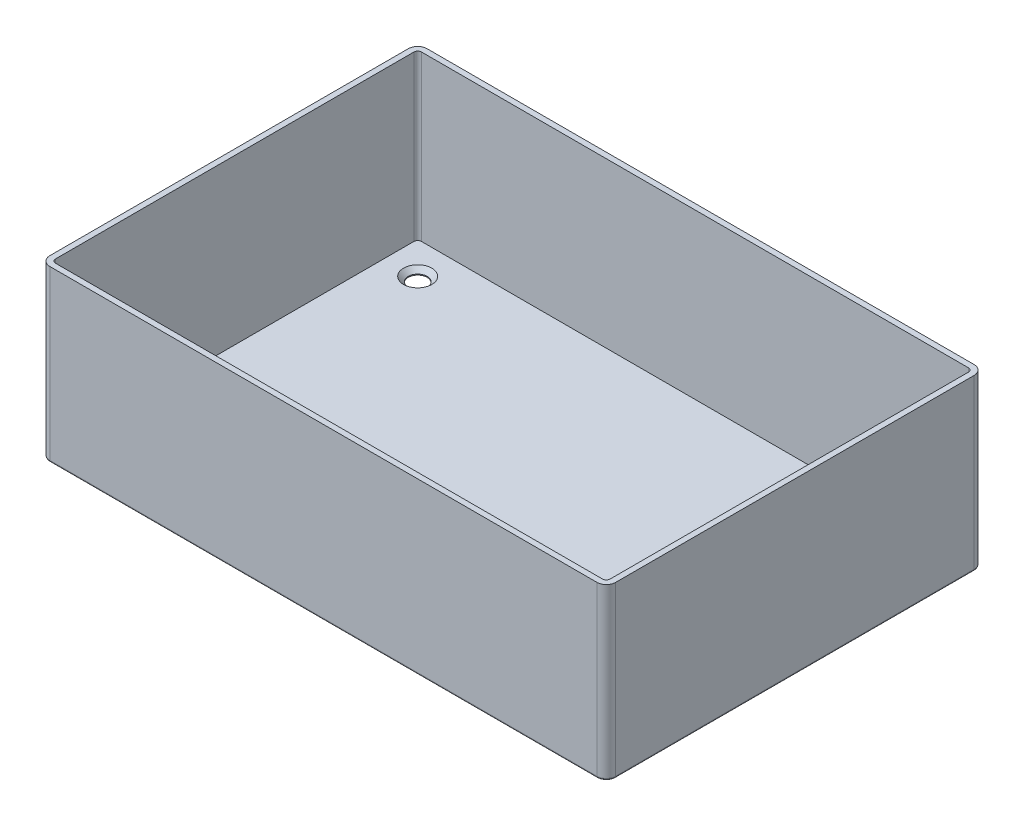
ISO-10303-21;
HEADER;
FILE_DESCRIPTION(('STEP AP214'),'2;1');
FILE_NAME('part.step','',(''),(''),'','','');
FILE_SCHEMA(('AUTOMOTIVE_DESIGN { 1 0 10303 214 1 1 1 1 }'));
ENDSEC;
DATA;
#1=APPLICATION_CONTEXT('core data for automotive mechanical design processes');
#2=APPLICATION_PROTOCOL_DEFINITION('international standard','automotive_design',2000,#1);
#3=PRODUCT_CONTEXT('',#1,'mechanical');
#4=PRODUCT('Part','Part','',(#3));
#5=PRODUCT_RELATED_PRODUCT_CATEGORY('part','',(#4));
#6=PRODUCT_DEFINITION_FORMATION('','',#4);
#7=PRODUCT_DEFINITION_CONTEXT('part definition',#1,'design');
#8=PRODUCT_DEFINITION('design','',#6,#7);
#9=PRODUCT_DEFINITION_SHAPE('','',#8);
#10=(LENGTH_UNIT() NAMED_UNIT(*) SI_UNIT(.MILLI.,.METRE.));
#11=(NAMED_UNIT(*) PLANE_ANGLE_UNIT() SI_UNIT($,.RADIAN.));
#12=(NAMED_UNIT(*) SI_UNIT($,.STERADIAN.) SOLID_ANGLE_UNIT());
#13=UNCERTAINTY_MEASURE_WITH_UNIT(LENGTH_MEASURE(1.E-05),#10,'distance_accuracy_value','');
#14=(GEOMETRIC_REPRESENTATION_CONTEXT(3) GLOBAL_UNCERTAINTY_ASSIGNED_CONTEXT((#13)) GLOBAL_UNIT_ASSIGNED_CONTEXT((#10,
#11,#12)) REPRESENTATION_CONTEXT('',''));
#15=CARTESIAN_POINT('',(0.,0.,0.));
#16=DIRECTION('',(0.,0.,1.));
#17=DIRECTION('',(1.,0.,0.));
#18=AXIS2_PLACEMENT_3D('',#15,#16,#17);
#19=CARTESIAN_POINT('',(-72.5,50.,-47.5));
#20=DIRECTION('',(0.,-1.,0.));
#21=DIRECTION('',(0.,0.,-1.));
#22=AXIS2_PLACEMENT_3D('',#19,#20,#21);
#23=CYLINDRICAL_SURFACE('',#22,2.5);
#24=DIRECTION('',(0.,-1.,0.));
#25=VECTOR('',#24,1.);
#26=CARTESIAN_POINT('',(-72.5,50.,-50.));
#27=LINE('',#26,#25);
#28=CARTESIAN_POINT('',(-72.5,45.,-50.));
#29=VERTEX_POINT('',#28);
#30=CARTESIAN_POINT('',(-72.5,0.5,-50.));
#31=VERTEX_POINT('',#30);
#32=EDGE_CURVE('E210',#29,#31,#27,.T.);
#33=ORIENTED_EDGE('',*,*,#32,.T.);
#34=CARTESIAN_POINT('',(-72.5,0.5,-47.5));
#35=DIRECTION('',(0.,-1.,0.));
#36=DIRECTION('',(0.,0.,-1.));
#37=AXIS2_PLACEMENT_3D('',#34,#35,#36);
#38=CIRCLE('',#37,2.5);
#39=CARTESIAN_POINT('',(-75.,0.5,-47.5));
#40=VERTEX_POINT('',#39);
#41=EDGE_CURVE('E252',#31,#40,#38,.F.);
#42=ORIENTED_EDGE('',*,*,#41,.T.);
#43=DIRECTION('',(0.,-1.,0.));
#44=VECTOR('',#43,1.);
#45=CARTESIAN_POINT('',(-75.,50.,-47.5));
#46=LINE('',#45,#44);
#47=CARTESIAN_POINT('',(-75.,45.,-47.5));
#48=VERTEX_POINT('',#47);
#49=EDGE_CURVE('E185',#48,#40,#46,.T.);
#50=ORIENTED_EDGE('',*,*,#49,.F.);
#51=CARTESIAN_POINT('',(-72.5,45.,-47.5));
#52=DIRECTION('',(0.,1.,0.));
#53=DIRECTION('',(0.,0.,1.));
#54=AXIS2_PLACEMENT_3D('',#51,#52,#53);
#55=CIRCLE('',#54,2.5);
#56=EDGE_CURVE('E380',#29,#48,#55,.T.);
#57=ORIENTED_EDGE('',*,*,#56,.F.);
#58=EDGE_LOOP('',(#33,#42,#50,#57));
#59=FACE_BOUND('',#58,.T.);
#60=ADVANCED_FACE('F34',(#59),#23,.T.);
#61=CARTESIAN_POINT('',(-75.,50.,47.5));
#62=DIRECTION('',(1.,0.,0.));
#63=DIRECTION('',(0.,0.,-1.));
#64=AXIS2_PLACEMENT_3D('',#61,#62,#63);
#65=PLANE('',#64);
#66=ORIENTED_EDGE('',*,*,#49,.T.);
#67=DIRECTION('',(0.,0.,1.));
#68=VECTOR('',#67,1.);
#69=CARTESIAN_POINT('',(-75.,0.5,47.5));
#70=LINE('',#69,#68);
#71=CARTESIAN_POINT('',(-75.,0.5,47.5));
#72=VERTEX_POINT('',#71);
#73=EDGE_CURVE('E57',#40,#72,#70,.T.);
#74=ORIENTED_EDGE('',*,*,#73,.T.);
#75=DIRECTION('',(0.,-1.,0.));
#76=VECTOR('',#75,1.);
#77=CARTESIAN_POINT('',(-75.,50.,47.5));
#78=LINE('',#77,#76);
#79=CARTESIAN_POINT('',(-75.,45.,47.5));
#80=VERTEX_POINT('',#79);
#81=EDGE_CURVE('E228',#80,#72,#78,.T.);
#82=ORIENTED_EDGE('',*,*,#81,.F.);
#83=DIRECTION('',(0.,0.,1.));
#84=VECTOR('',#83,1.);
#85=CARTESIAN_POINT('',(-75.,45.,47.5));
#86=LINE('',#85,#84);
#87=EDGE_CURVE('E385',#48,#80,#86,.T.);
#88=ORIENTED_EDGE('',*,*,#87,.F.);
#89=EDGE_LOOP('',(#66,#74,#82,#88));
#90=FACE_BOUND('',#89,.T.);
#91=ADVANCED_FACE('F320',(#90),#65,.F.);
#92=CARTESIAN_POINT('',(-72.5,50.,47.5));
#93=DIRECTION('',(0.,-1.,0.));
#94=DIRECTION('',(0.,0.,-1.));
#95=AXIS2_PLACEMENT_3D('',#92,#93,#94);
#96=CYLINDRICAL_SURFACE('',#95,2.5);
#97=ORIENTED_EDGE('',*,*,#81,.T.);
#98=CARTESIAN_POINT('',(-72.5,0.5,47.5));
#99=DIRECTION('',(0.,-1.,0.));
#100=DIRECTION('',(0.,0.,-1.));
#101=AXIS2_PLACEMENT_3D('',#98,#99,#100);
#102=CIRCLE('',#101,2.5);
#103=CARTESIAN_POINT('',(-72.5,0.5,50.));
#104=VERTEX_POINT('',#103);
#105=EDGE_CURVE('E49',#72,#104,#102,.F.);
#106=ORIENTED_EDGE('',*,*,#105,.T.);
#107=DIRECTION('',(0.,-1.,0.));
#108=VECTOR('',#107,1.);
#109=CARTESIAN_POINT('',(-72.5,50.,50.));
#110=LINE('',#109,#108);
#111=CARTESIAN_POINT('',(-72.5,45.,50.));
#112=VERTEX_POINT('',#111);
#113=EDGE_CURVE('E226',#112,#104,#110,.T.);
#114=ORIENTED_EDGE('',*,*,#113,.F.);
#115=CARTESIAN_POINT('',(-72.5,45.,47.5));
#116=DIRECTION('',(0.,1.,0.));
#117=DIRECTION('',(0.,0.,1.));
#118=AXIS2_PLACEMENT_3D('',#115,#116,#117);
#119=CIRCLE('',#118,2.5);
#120=EDGE_CURVE('E469',#80,#112,#119,.T.);
#121=ORIENTED_EDGE('',*,*,#120,.F.);
#122=EDGE_LOOP('',(#97,#106,#114,#121));
#123=FACE_BOUND('',#122,.T.);
#124=ADVANCED_FACE('F326',(#123),#96,.T.);
#125=CARTESIAN_POINT('',(-72.5,50.,50.));
#126=DIRECTION('',(0.,0.,-1.));
#127=DIRECTION('',(-1.,0.,0.));
#128=AXIS2_PLACEMENT_3D('',#125,#126,#127);
#129=PLANE('',#128);
#130=ORIENTED_EDGE('',*,*,#113,.T.);
#131=DIRECTION('',(1.,0.,0.));
#132=VECTOR('',#131,1.);
#133=CARTESIAN_POINT('',(72.5,0.5,50.));
#134=LINE('',#133,#132);
#135=CARTESIAN_POINT('',(72.5,0.5,50.));
#136=VERTEX_POINT('',#135);
#137=EDGE_CURVE('E260',#104,#136,#134,.T.);
#138=ORIENTED_EDGE('',*,*,#137,.T.);
#139=DIRECTION('',(0.,-1.,0.));
#140=VECTOR('',#139,1.);
#141=CARTESIAN_POINT('',(72.5,50.,50.));
#142=LINE('',#141,#140);
#143=CARTESIAN_POINT('',(72.5,45.,50.));
#144=VERTEX_POINT('',#143);
#145=EDGE_CURVE('E223',#144,#136,#142,.T.);
#146=ORIENTED_EDGE('',*,*,#145,.F.);
#147=DIRECTION('',(1.,0.,0.));
#148=VECTOR('',#147,1.);
#149=CARTESIAN_POINT('',(-72.5,45.,50.));
#150=LINE('',#149,#148);
#151=EDGE_CURVE('E467',#112,#144,#150,.T.);
#152=ORIENTED_EDGE('',*,*,#151,.F.);
#153=EDGE_LOOP('',(#130,#138,#146,#152));
#154=FACE_BOUND('',#153,.T.);
#155=ADVANCED_FACE('F489',(#154),#129,.F.);
#156=CARTESIAN_POINT('',(72.5,50.,47.5));
#157=DIRECTION('',(0.,-1.,0.));
#158=DIRECTION('',(0.,0.,-1.));
#159=AXIS2_PLACEMENT_3D('',#156,#157,#158);
#160=CYLINDRICAL_SURFACE('',#159,2.5);
#161=ORIENTED_EDGE('',*,*,#145,.T.);
#162=CARTESIAN_POINT('',(72.5,0.5,47.5));
#163=DIRECTION('',(0.,-1.,0.));
#164=DIRECTION('',(0.,0.,-1.));
#165=AXIS2_PLACEMENT_3D('',#162,#163,#164);
#166=CIRCLE('',#165,2.5);
#167=CARTESIAN_POINT('',(75.,0.5,47.5));
#168=VERTEX_POINT('',#167);
#169=EDGE_CURVE('E184',#136,#168,#166,.F.);
#170=ORIENTED_EDGE('',*,*,#169,.T.);
#171=DIRECTION('',(0.,-1.,0.));
#172=VECTOR('',#171,1.);
#173=CARTESIAN_POINT('',(75.,50.,47.5));
#174=LINE('',#173,#172);
#175=CARTESIAN_POINT('',(75.,45.,47.5));
#176=VERTEX_POINT('',#175);
#177=EDGE_CURVE('E220',#176,#168,#174,.T.);
#178=ORIENTED_EDGE('',*,*,#177,.F.);
#179=CARTESIAN_POINT('',(72.5,45.,47.5));
#180=DIRECTION('',(0.,1.,0.));
#181=DIRECTION('',(0.,0.,1.));
#182=AXIS2_PLACEMENT_3D('',#179,#180,#181);
#183=CIRCLE('',#182,2.5);
#184=EDGE_CURVE('E465',#144,#176,#183,.T.);
#185=ORIENTED_EDGE('',*,*,#184,.F.);
#186=EDGE_LOOP('',(#161,#170,#178,#185));
#187=FACE_BOUND('',#186,.T.);
#188=ADVANCED_FACE('F492',(#187),#160,.T.);
#189=CARTESIAN_POINT('',(75.,50.,47.5));
#190=DIRECTION('',(-1.,0.,0.));
#191=DIRECTION('',(0.,0.,1.));
#192=AXIS2_PLACEMENT_3D('',#189,#190,#191);
#193=PLANE('',#192);
#194=ORIENTED_EDGE('',*,*,#177,.T.);
#195=DIRECTION('',(0.,0.,-1.));
#196=VECTOR('',#195,1.);
#197=CARTESIAN_POINT('',(75.,0.5,-47.5));
#198=LINE('',#197,#196);
#199=CARTESIAN_POINT('',(75.,0.5,-47.5));
#200=VERTEX_POINT('',#199);
#201=EDGE_CURVE('E258',#168,#200,#198,.T.);
#202=ORIENTED_EDGE('',*,*,#201,.T.);
#203=DIRECTION('',(0.,-1.,0.));
#204=VECTOR('',#203,1.);
#205=CARTESIAN_POINT('',(75.,50.,-47.5));
#206=LINE('',#205,#204);
#207=CARTESIAN_POINT('',(75.,45.,-47.5));
#208=VERTEX_POINT('',#207);
#209=EDGE_CURVE('E217',#208,#200,#206,.T.);
#210=ORIENTED_EDGE('',*,*,#209,.F.);
#211=DIRECTION('',(0.,0.,-1.));
#212=VECTOR('',#211,1.);
#213=CARTESIAN_POINT('',(75.,45.,47.5));
#214=LINE('',#213,#212);
#215=EDGE_CURVE('E463',#176,#208,#214,.T.);
#216=ORIENTED_EDGE('',*,*,#215,.F.);
#217=EDGE_LOOP('',(#194,#202,#210,#216));
#218=FACE_BOUND('',#217,.T.);
#219=ADVANCED_FACE('F498',(#218),#193,.F.);
#220=CARTESIAN_POINT('',(72.5,50.,-47.5));
#221=DIRECTION('',(0.,-1.,0.));
#222=DIRECTION('',(0.,0.,-1.));
#223=AXIS2_PLACEMENT_3D('',#220,#221,#222);
#224=CYLINDRICAL_SURFACE('',#223,2.5);
#225=ORIENTED_EDGE('',*,*,#209,.T.);
#226=CARTESIAN_POINT('',(72.5,0.5,-47.5));
#227=DIRECTION('',(0.,-1.,0.));
#228=DIRECTION('',(0.,0.,-1.));
#229=AXIS2_PLACEMENT_3D('',#226,#227,#228);
#230=CIRCLE('',#229,2.5);
#231=CARTESIAN_POINT('',(72.5,0.5,-50.));
#232=VERTEX_POINT('',#231);
#233=EDGE_CURVE('E250',#200,#232,#230,.F.);
#234=ORIENTED_EDGE('',*,*,#233,.T.);
#235=DIRECTION('',(0.,-1.,0.));
#236=VECTOR('',#235,1.);
#237=CARTESIAN_POINT('',(72.5,50.,-50.));
#238=LINE('',#237,#236);
#239=CARTESIAN_POINT('',(72.5,45.,-50.));
#240=VERTEX_POINT('',#239);
#241=EDGE_CURVE('E213',#240,#232,#238,.T.);
#242=ORIENTED_EDGE('',*,*,#241,.F.);
#243=CARTESIAN_POINT('',(72.5,45.,-47.5));
#244=DIRECTION('',(0.,1.,0.));
#245=DIRECTION('',(0.,0.,1.));
#246=AXIS2_PLACEMENT_3D('',#243,#244,#245);
#247=CIRCLE('',#246,2.5);
#248=EDGE_CURVE('E461',#208,#240,#247,.T.);
#249=ORIENTED_EDGE('',*,*,#248,.F.);
#250=EDGE_LOOP('',(#225,#234,#242,#249));
#251=FACE_BOUND('',#250,.T.);
#252=ADVANCED_FACE('F502',(#251),#224,.T.);
#253=CARTESIAN_POINT('',(-72.5,50.,-50.));
#254=DIRECTION('',(0.,0.,1.));
#255=DIRECTION('',(1.,0.,0.));
#256=AXIS2_PLACEMENT_3D('',#253,#254,#255);
#257=PLANE('',#256);
#258=ORIENTED_EDGE('',*,*,#241,.T.);
#259=DIRECTION('',(-1.,0.,0.));
#260=VECTOR('',#259,1.);
#261=CARTESIAN_POINT('',(-72.5,0.5,-50.));
#262=LINE('',#261,#260);
#263=EDGE_CURVE('E256',#232,#31,#262,.T.);
#264=ORIENTED_EDGE('',*,*,#263,.T.);
#265=ORIENTED_EDGE('',*,*,#32,.F.);
#266=DIRECTION('',(-1.,0.,0.));
#267=VECTOR('',#266,1.);
#268=CARTESIAN_POINT('',(-72.5,45.,-50.));
#269=LINE('',#268,#267);
#270=EDGE_CURVE('E459',#240,#29,#269,.T.);
#271=ORIENTED_EDGE('',*,*,#270,.F.);
#272=EDGE_LOOP('',(#258,#264,#265,#271));
#273=FACE_BOUND('',#272,.T.);
#274=ADVANCED_FACE('F516',(#273),#257,.F.);
#275=CARTESIAN_POINT('',(-72.5,50.,-47.5));
#276=DIRECTION('',(0.,-1.,0.));
#277=DIRECTION('',(0.,0.,-1.));
#278=AXIS2_PLACEMENT_3D('',#275,#276,#277);
#279=CYLINDRICAL_SURFACE('',#278,1.);
#280=DIRECTION('',(0.,-1.,0.));
#281=VECTOR('',#280,1.);
#282=CARTESIAN_POINT('',(-72.5,50.,-48.5));
#283=LINE('',#282,#281);
#284=CARTESIAN_POINT('',(-72.5,45.,-48.5));
#285=VERTEX_POINT('',#284);
#286=CARTESIAN_POINT('',(-72.5,1.5,-48.5));
#287=VERTEX_POINT('',#286);
#288=EDGE_CURVE('E201',#285,#287,#283,.T.);
#289=ORIENTED_EDGE('',*,*,#288,.F.);
#290=CARTESIAN_POINT('',(-72.5,45.,-47.5));
#291=DIRECTION('',(0.,1.,0.));
#292=DIRECTION('',(0.,0.,1.));
#293=AXIS2_PLACEMENT_3D('',#290,#291,#292);
#294=CIRCLE('',#293,1.);
#295=CARTESIAN_POINT('',(-73.5,45.,-47.5));
#296=VERTEX_POINT('',#295);
#297=EDGE_CURVE('E180',#285,#296,#294,.T.);
#298=ORIENTED_EDGE('',*,*,#297,.T.);
#299=DIRECTION('',(0.,1.,0.));
#300=VECTOR('',#299,1.);
#301=CARTESIAN_POINT('',(-73.5,50.,-47.5));
#302=LINE('',#301,#300);
#303=CARTESIAN_POINT('',(-73.5,1.5,-47.5));
#304=VERTEX_POINT('',#303);
#305=EDGE_CURVE('E214',#296,#304,#302,.F.);
#306=ORIENTED_EDGE('',*,*,#305,.T.);
#307=CARTESIAN_POINT('',(-72.5,1.5,-47.5));
#308=DIRECTION('',(0.,-1.,0.));
#309=DIRECTION('',(0.,0.,-1.));
#310=AXIS2_PLACEMENT_3D('',#307,#308,#309);
#311=CIRCLE('',#310,1.);
#312=EDGE_CURVE('E394',#287,#304,#311,.F.);
#313=ORIENTED_EDGE('',*,*,#312,.F.);
#314=EDGE_LOOP('',(#289,#298,#306,#313));
#315=FACE_BOUND('',#314,.T.);
#316=ADVANCED_FACE('F424',(#315),#279,.F.);
#317=CARTESIAN_POINT('',(-73.5,50.,47.5));
#318=DIRECTION('',(1.,0.,0.));
#319=DIRECTION('',(0.,0.,-1.));
#320=AXIS2_PLACEMENT_3D('',#317,#318,#319);
#321=PLANE('',#320);
#322=ORIENTED_EDGE('',*,*,#305,.F.);
#323=DIRECTION('',(0.,0.,1.));
#324=VECTOR('',#323,1.);
#325=CARTESIAN_POINT('',(-73.5,45.,47.5));
#326=LINE('',#325,#324);
#327=CARTESIAN_POINT('',(-73.5,45.,47.5));
#328=VERTEX_POINT('',#327);
#329=EDGE_CURVE('E456',#296,#328,#326,.T.);
#330=ORIENTED_EDGE('',*,*,#329,.T.);
#331=DIRECTION('',(0.,-1.,0.));
#332=VECTOR('',#331,1.);
#333=CARTESIAN_POINT('',(-73.5,50.,47.5));
#334=LINE('',#333,#332);
#335=CARTESIAN_POINT('',(-73.5,1.5,47.5));
#336=VERTEX_POINT('',#335);
#337=EDGE_CURVE('E398',#328,#336,#334,.T.);
#338=ORIENTED_EDGE('',*,*,#337,.T.);
#339=DIRECTION('',(0.,0.,1.));
#340=VECTOR('',#339,1.);
#341=CARTESIAN_POINT('',(-73.5,1.5,-47.5));
#342=LINE('',#341,#340);
#343=EDGE_CURVE('E397',#304,#336,#342,.T.);
#344=ORIENTED_EDGE('',*,*,#343,.F.);
#345=EDGE_LOOP('',(#322,#330,#338,#344));
#346=FACE_BOUND('',#345,.T.);
#347=ADVANCED_FACE('F429',(#346),#321,.T.);
#348=CARTESIAN_POINT('',(-72.5,50.,47.5));
#349=DIRECTION('',(0.,-1.,0.));
#350=DIRECTION('',(0.,0.,-1.));
#351=AXIS2_PLACEMENT_3D('',#348,#349,#350);
#352=CYLINDRICAL_SURFACE('',#351,1.);
#353=ORIENTED_EDGE('',*,*,#337,.F.);
#354=CARTESIAN_POINT('',(-72.5,45.,47.5));
#355=DIRECTION('',(0.,1.,0.));
#356=DIRECTION('',(0.,0.,1.));
#357=AXIS2_PLACEMENT_3D('',#354,#355,#356);
#358=CIRCLE('',#357,1.);
#359=CARTESIAN_POINT('',(-72.5,45.,48.5));
#360=VERTEX_POINT('',#359);
#361=EDGE_CURVE('E437',#328,#360,#358,.T.);
#362=ORIENTED_EDGE('',*,*,#361,.T.);
#363=DIRECTION('',(0.,1.,0.));
#364=VECTOR('',#363,1.);
#365=CARTESIAN_POINT('',(-72.5,50.,48.5));
#366=LINE('',#365,#364);
#367=CARTESIAN_POINT('',(-72.5,1.5,48.5));
#368=VERTEX_POINT('',#367);
#369=EDGE_CURVE('E404',#360,#368,#366,.F.);
#370=ORIENTED_EDGE('',*,*,#369,.T.);
#371=CARTESIAN_POINT('',(-72.5,1.5,47.5));
#372=DIRECTION('',(0.,-1.,0.));
#373=DIRECTION('',(0.,0.,-1.));
#374=AXIS2_PLACEMENT_3D('',#371,#372,#373);
#375=CIRCLE('',#374,1.);
#376=EDGE_CURVE('E402',#336,#368,#375,.F.);
#377=ORIENTED_EDGE('',*,*,#376,.F.);
#378=EDGE_LOOP('',(#353,#362,#370,#377));
#379=FACE_BOUND('',#378,.T.);
#380=ADVANCED_FACE('F434',(#379),#352,.F.);
#381=CARTESIAN_POINT('',(-72.5,50.,48.5));
#382=DIRECTION('',(0.,0.,-1.));
#383=DIRECTION('',(-1.,0.,0.));
#384=AXIS2_PLACEMENT_3D('',#381,#382,#383);
#385=PLANE('',#384);
#386=ORIENTED_EDGE('',*,*,#369,.F.);
#387=DIRECTION('',(1.,0.,0.));
#388=VECTOR('',#387,1.);
#389=CARTESIAN_POINT('',(-72.5,45.,48.5));
#390=LINE('',#389,#388);
#391=CARTESIAN_POINT('',(72.5,45.,48.5));
#392=VERTEX_POINT('',#391);
#393=EDGE_CURVE('E441',#360,#392,#390,.T.);
#394=ORIENTED_EDGE('',*,*,#393,.T.);
#395=DIRECTION('',(0.,-1.,0.));
#396=VECTOR('',#395,1.);
#397=CARTESIAN_POINT('',(72.5,50.,48.5));
#398=LINE('',#397,#396);
#399=CARTESIAN_POINT('',(72.5,1.5,48.5));
#400=VERTEX_POINT('',#399);
#401=EDGE_CURVE('E409',#392,#400,#398,.T.);
#402=ORIENTED_EDGE('',*,*,#401,.T.);
#403=DIRECTION('',(1.,0.,0.));
#404=VECTOR('',#403,1.);
#405=CARTESIAN_POINT('',(-72.5,1.5,48.5));
#406=LINE('',#405,#404);
#407=EDGE_CURVE('E407',#368,#400,#406,.T.);
#408=ORIENTED_EDGE('',*,*,#407,.F.);
#409=EDGE_LOOP('',(#386,#394,#402,#408));
#410=FACE_BOUND('',#409,.T.);
#411=ADVANCED_FACE('F440',(#410),#385,.T.);
#412=CARTESIAN_POINT('',(72.5,50.,47.5));
#413=DIRECTION('',(0.,-1.,0.));
#414=DIRECTION('',(0.,0.,-1.));
#415=AXIS2_PLACEMENT_3D('',#412,#413,#414);
#416=CYLINDRICAL_SURFACE('',#415,1.);
#417=ORIENTED_EDGE('',*,*,#401,.F.);
#418=CARTESIAN_POINT('',(72.5,45.,47.5));
#419=DIRECTION('',(0.,1.,0.));
#420=DIRECTION('',(0.,0.,1.));
#421=AXIS2_PLACEMENT_3D('',#418,#419,#420);
#422=CIRCLE('',#421,1.);
#423=CARTESIAN_POINT('',(73.5,45.,47.5));
#424=VERTEX_POINT('',#423);
#425=EDGE_CURVE('E448',#392,#424,#422,.T.);
#426=ORIENTED_EDGE('',*,*,#425,.T.);
#427=DIRECTION('',(0.,1.,0.));
#428=VECTOR('',#427,1.);
#429=CARTESIAN_POINT('',(73.5,50.,47.5));
#430=LINE('',#429,#428);
#431=CARTESIAN_POINT('',(73.5,1.5,47.5));
#432=VERTEX_POINT('',#431);
#433=EDGE_CURVE('E203',#424,#432,#430,.F.);
#434=ORIENTED_EDGE('',*,*,#433,.T.);
#435=CARTESIAN_POINT('',(72.5,1.5,47.5));
#436=DIRECTION('',(0.,-1.,0.));
#437=DIRECTION('',(0.,0.,-1.));
#438=AXIS2_PLACEMENT_3D('',#435,#436,#437);
#439=CIRCLE('',#438,1.);
#440=EDGE_CURVE('E412',#400,#432,#439,.F.);
#441=ORIENTED_EDGE('',*,*,#440,.F.);
#442=EDGE_LOOP('',(#417,#426,#434,#441));
#443=FACE_BOUND('',#442,.T.);
#444=ADVANCED_FACE('F445',(#443),#416,.F.);
#445=CARTESIAN_POINT('',(73.5,50.,47.5));
#446=DIRECTION('',(-1.,0.,0.));
#447=DIRECTION('',(0.,0.,1.));
#448=AXIS2_PLACEMENT_3D('',#445,#446,#447);
#449=PLANE('',#448);
#450=ORIENTED_EDGE('',*,*,#433,.F.);
#451=DIRECTION('',(0.,0.,-1.));
#452=VECTOR('',#451,1.);
#453=CARTESIAN_POINT('',(73.5,45.,47.5));
#454=LINE('',#453,#452);
#455=CARTESIAN_POINT('',(73.5,45.,-47.5));
#456=VERTEX_POINT('',#455);
#457=EDGE_CURVE('E194',#424,#456,#454,.T.);
#458=ORIENTED_EDGE('',*,*,#457,.T.);
#459=DIRECTION('',(0.,-1.,0.));
#460=VECTOR('',#459,1.);
#461=CARTESIAN_POINT('',(73.5,50.,-47.5));
#462=LINE('',#461,#460);
#463=CARTESIAN_POINT('',(73.5,1.5,-47.5));
#464=VERTEX_POINT('',#463);
#465=EDGE_CURVE('E193',#456,#464,#462,.T.);
#466=ORIENTED_EDGE('',*,*,#465,.T.);
#467=DIRECTION('',(0.,0.,-1.));
#468=VECTOR('',#467,1.);
#469=CARTESIAN_POINT('',(73.5,1.5,-47.5));
#470=LINE('',#469,#468);
#471=EDGE_CURVE('E416',#432,#464,#470,.T.);
#472=ORIENTED_EDGE('',*,*,#471,.F.);
#473=EDGE_LOOP('',(#450,#458,#466,#472));
#474=FACE_BOUND('',#473,.T.);
#475=ADVANCED_FACE('F450',(#474),#449,.T.);
#476=CARTESIAN_POINT('',(72.5,50.,-47.5));
#477=DIRECTION('',(0.,-1.,0.));
#478=DIRECTION('',(0.,0.,-1.));
#479=AXIS2_PLACEMENT_3D('',#476,#477,#478);
#480=CYLINDRICAL_SURFACE('',#479,1.);
#481=ORIENTED_EDGE('',*,*,#465,.F.);
#482=CARTESIAN_POINT('',(72.5,45.,-47.5));
#483=DIRECTION('',(0.,1.,0.));
#484=DIRECTION('',(0.,0.,1.));
#485=AXIS2_PLACEMENT_3D('',#482,#483,#484);
#486=CIRCLE('',#485,1.);
#487=CARTESIAN_POINT('',(72.5,45.,-48.5));
#488=VERTEX_POINT('',#487);
#489=EDGE_CURVE('E177',#456,#488,#486,.T.);
#490=ORIENTED_EDGE('',*,*,#489,.T.);
#491=DIRECTION('',(0.,1.,0.));
#492=VECTOR('',#491,1.);
#493=CARTESIAN_POINT('',(72.5,50.,-48.5));
#494=LINE('',#493,#492);
#495=CARTESIAN_POINT('',(72.5,1.5,-48.5));
#496=VERTEX_POINT('',#495);
#497=EDGE_CURVE('E191',#488,#496,#494,.F.);
#498=ORIENTED_EDGE('',*,*,#497,.T.);
#499=CARTESIAN_POINT('',(72.5,1.5,-47.5));
#500=DIRECTION('',(0.,-1.,0.));
#501=DIRECTION('',(0.,0.,-1.));
#502=AXIS2_PLACEMENT_3D('',#499,#500,#501);
#503=CIRCLE('',#502,1.);
#504=EDGE_CURVE('E208',#464,#496,#503,.F.);
#505=ORIENTED_EDGE('',*,*,#504,.F.);
#506=EDGE_LOOP('',(#481,#490,#498,#505));
#507=FACE_BOUND('',#506,.T.);
#508=ADVANCED_FACE('F189',(#507),#480,.F.);
#509=CARTESIAN_POINT('',(-72.5,50.,-48.5));
#510=DIRECTION('',(0.,0.,1.));
#511=DIRECTION('',(1.,0.,0.));
#512=AXIS2_PLACEMENT_3D('',#509,#510,#511);
#513=PLANE('',#512);
#514=ORIENTED_EDGE('',*,*,#497,.F.);
#515=DIRECTION('',(-1.,0.,0.));
#516=VECTOR('',#515,1.);
#517=CARTESIAN_POINT('',(-72.5,45.,-48.5));
#518=LINE('',#517,#516);
#519=EDGE_CURVE('E173',#488,#285,#518,.T.);
#520=ORIENTED_EDGE('',*,*,#519,.T.);
#521=ORIENTED_EDGE('',*,*,#288,.T.);
#522=DIRECTION('',(-1.,0.,0.));
#523=VECTOR('',#522,1.);
#524=CARTESIAN_POINT('',(-72.5,1.5,-48.5));
#525=LINE('',#524,#523);
#526=EDGE_CURVE('E200',#496,#287,#525,.T.);
#527=ORIENTED_EDGE('',*,*,#526,.F.);
#528=EDGE_LOOP('',(#514,#520,#521,#527));
#529=FACE_BOUND('',#528,.T.);
#530=ADVANCED_FACE('F198',(#529),#513,.T.);
#531=CARTESIAN_POINT('',(-72.5,0.,-47.5));
#532=DIRECTION('',(0.,-1.,0.));
#533=DIRECTION('',(0.,0.,-1.));
#534=AXIS2_PLACEMENT_3D('',#531,#532,#533);
#535=PLANE('',#534);
#536=CARTESIAN_POINT('',(-72.5,0.,-47.5));
#537=DIRECTION('',(0.,-1.,0.));
#538=DIRECTION('',(0.,0.,-1.));
#539=AXIS2_PLACEMENT_3D('',#536,#537,#538);
#540=CIRCLE('',#539,2.);
#541=CARTESIAN_POINT('',(-74.5,0.,-47.5));
#542=VERTEX_POINT('',#541);
#543=CARTESIAN_POINT('',(-72.5,0.,-49.5));
#544=VERTEX_POINT('',#543);
#545=EDGE_CURVE('E244',#542,#544,#540,.T.);
#546=ORIENTED_EDGE('',*,*,#545,.T.);
#547=DIRECTION('',(-1.,0.,0.));
#548=VECTOR('',#547,1.);
#549=CARTESIAN_POINT('',(72.5,0.,-49.5));
#550=LINE('',#549,#548);
#551=CARTESIAN_POINT('',(72.5,0.,-49.5));
#552=VERTEX_POINT('',#551);
#553=EDGE_CURVE('E248',#544,#552,#550,.F.);
#554=ORIENTED_EDGE('',*,*,#553,.T.);
#555=CARTESIAN_POINT('',(72.5,0.,-47.5));
#556=DIRECTION('',(0.,-1.,0.));
#557=DIRECTION('',(0.,0.,-1.));
#558=AXIS2_PLACEMENT_3D('',#555,#556,#557);
#559=CIRCLE('',#558,2.);
#560=CARTESIAN_POINT('',(74.5,0.,-47.5));
#561=VERTEX_POINT('',#560);
#562=EDGE_CURVE('E246',#552,#561,#559,.T.);
#563=ORIENTED_EDGE('',*,*,#562,.T.);
#564=DIRECTION('',(0.,0.,-1.));
#565=VECTOR('',#564,1.);
#566=CARTESIAN_POINT('',(74.5,0.,47.5));
#567=LINE('',#566,#565);
#568=CARTESIAN_POINT('',(74.5,0.,47.5));
#569=VERTEX_POINT('',#568);
#570=EDGE_CURVE('E240',#561,#569,#567,.F.);
#571=ORIENTED_EDGE('',*,*,#570,.T.);
#572=CARTESIAN_POINT('',(72.5,0.,47.5));
#573=DIRECTION('',(0.,-1.,0.));
#574=DIRECTION('',(0.,0.,-1.));
#575=AXIS2_PLACEMENT_3D('',#572,#573,#574);
#576=CIRCLE('',#575,2.);
#577=CARTESIAN_POINT('',(72.5,0.,49.5));
#578=VERTEX_POINT('',#577);
#579=EDGE_CURVE('E237',#569,#578,#576,.T.);
#580=ORIENTED_EDGE('',*,*,#579,.T.);
#581=DIRECTION('',(1.,0.,0.));
#582=VECTOR('',#581,1.);
#583=CARTESIAN_POINT('',(-72.5,0.,49.5));
#584=LINE('',#583,#582);
#585=CARTESIAN_POINT('',(-72.5,0.,49.5));
#586=VERTEX_POINT('',#585);
#587=EDGE_CURVE('E233',#578,#586,#584,.F.);
#588=ORIENTED_EDGE('',*,*,#587,.T.);
#589=CARTESIAN_POINT('',(-72.5,0.,47.5));
#590=DIRECTION('',(0.,-1.,0.));
#591=DIRECTION('',(0.,0.,-1.));
#592=AXIS2_PLACEMENT_3D('',#589,#590,#591);
#593=CIRCLE('',#592,2.);
#594=CARTESIAN_POINT('',(-74.5,0.,47.5));
#595=VERTEX_POINT('',#594);
#596=EDGE_CURVE('E235',#586,#595,#593,.T.);
#597=ORIENTED_EDGE('',*,*,#596,.T.);
#598=DIRECTION('',(0.,0.,1.));
#599=VECTOR('',#598,1.);
#600=CARTESIAN_POINT('',(-74.5,0.,-47.5));
#601=LINE('',#600,#599);
#602=EDGE_CURVE('E242',#595,#542,#601,.F.);
#603=ORIENTED_EDGE('',*,*,#602,.T.);
#604=EDGE_LOOP('',(#546,#554,#563,#571,#580,#588,#597,#603));
#605=FACE_BOUND('',#604,.T.);
#606=CARTESIAN_POINT('',(-65.,0.,40.));
#607=DIRECTION('',(0.,-1.,0.));
#608=DIRECTION('',(0.,0.,-1.));
#609=AXIS2_PLACEMENT_3D('',#606,#607,#608);
#610=CIRCLE('',#609,2.50000000000001);
#611=CARTESIAN_POINT('',(-65.,0.,37.5));
#612=VERTEX_POINT('',#611);
#613=EDGE_CURVE('E377',#612,#612,#610,.T.);
#614=ORIENTED_EDGE('',*,*,#613,.F.);
#615=EDGE_LOOP('',(#614));
#616=FACE_BOUND('',#615,.T.);
#617=CARTESIAN_POINT('',(65.,0.,40.));
#618=DIRECTION('',(0.,-1.,0.));
#619=DIRECTION('',(0.,0.,-1.));
#620=AXIS2_PLACEMENT_3D('',#617,#618,#619);
#621=CIRCLE('',#620,2.50000000000001);
#622=CARTESIAN_POINT('',(65.,0.,37.5));
#623=VERTEX_POINT('',#622);
#624=EDGE_CURVE('E379',#623,#623,#621,.T.);
#625=ORIENTED_EDGE('',*,*,#624,.F.);
#626=EDGE_LOOP('',(#625));
#627=FACE_BOUND('',#626,.T.);
#628=CARTESIAN_POINT('',(65.,0.,-40.));
#629=DIRECTION('',(0.,-1.,0.));
#630=DIRECTION('',(0.,0.,-1.));
#631=AXIS2_PLACEMENT_3D('',#628,#629,#630);
#632=CIRCLE('',#631,2.50000000000001);
#633=CARTESIAN_POINT('',(65.,0.,-42.5));
#634=VERTEX_POINT('',#633);
#635=EDGE_CURVE('E383',#634,#634,#632,.T.);
#636=ORIENTED_EDGE('',*,*,#635,.F.);
#637=EDGE_LOOP('',(#636));
#638=FACE_BOUND('',#637,.T.);
#639=CARTESIAN_POINT('',(-65.,0.,-40.));
#640=DIRECTION('',(0.,-1.,0.));
#641=DIRECTION('',(0.,0.,-1.));
#642=AXIS2_PLACEMENT_3D('',#639,#640,#641);
#643=CIRCLE('',#642,2.50000000000001);
#644=CARTESIAN_POINT('',(-65.,0.,-42.5));
#645=VERTEX_POINT('',#644);
#646=EDGE_CURVE('E391',#645,#645,#643,.T.);
#647=ORIENTED_EDGE('',*,*,#646,.F.);
#648=EDGE_LOOP('',(#647));
#649=FACE_BOUND('',#648,.T.);
#650=ADVANCED_FACE('F511',(#605,#616,#627,#638,#649),#535,.T.);
#651=CARTESIAN_POINT('',(-72.5,1.5,-47.5));
#652=DIRECTION('',(0.,-1.,0.));
#653=DIRECTION('',(0.,0.,-1.));
#654=AXIS2_PLACEMENT_3D('',#651,#652,#653);
#655=PLANE('',#654);
#656=CARTESIAN_POINT('',(-65.,1.5,40.));
#657=DIRECTION('',(0.,-1.,0.));
#658=DIRECTION('',(0.,0.,-1.));
#659=AXIS2_PLACEMENT_3D('',#656,#657,#658);
#660=CIRCLE('',#659,3.75000000000003);
#661=CARTESIAN_POINT('',(-65.,1.5,36.25));
#662=VERTEX_POINT('',#661);
#663=EDGE_CURVE('E295',#662,#662,#660,.T.);
#664=ORIENTED_EDGE('',*,*,#663,.T.);
#665=EDGE_LOOP('',(#664));
#666=FACE_BOUND('',#665,.T.);
#667=CARTESIAN_POINT('',(65.,1.5,40.));
#668=DIRECTION('',(0.,-1.,0.));
#669=DIRECTION('',(0.,0.,-1.));
#670=AXIS2_PLACEMENT_3D('',#667,#668,#669);
#671=CIRCLE('',#670,3.75000000000003);
#672=CARTESIAN_POINT('',(65.,1.5,36.25));
#673=VERTEX_POINT('',#672);
#674=EDGE_CURVE('E292',#673,#673,#671,.T.);
#675=ORIENTED_EDGE('',*,*,#674,.T.);
#676=EDGE_LOOP('',(#675));
#677=FACE_BOUND('',#676,.T.);
#678=CARTESIAN_POINT('',(65.,1.5,-40.));
#679=DIRECTION('',(0.,-1.,0.));
#680=DIRECTION('',(0.,0.,-1.));
#681=AXIS2_PLACEMENT_3D('',#678,#679,#680);
#682=CIRCLE('',#681,3.75000000000003);
#683=CARTESIAN_POINT('',(65.,1.5,-43.75));
#684=VERTEX_POINT('',#683);
#685=EDGE_CURVE('E289',#684,#684,#682,.T.);
#686=ORIENTED_EDGE('',*,*,#685,.T.);
#687=EDGE_LOOP('',(#686));
#688=FACE_BOUND('',#687,.T.);
#689=CARTESIAN_POINT('',(-65.,1.5,-40.));
#690=DIRECTION('',(0.,-1.,0.));
#691=DIRECTION('',(0.,0.,-1.));
#692=AXIS2_PLACEMENT_3D('',#689,#690,#691);
#693=CIRCLE('',#692,3.75000000000003);
#694=CARTESIAN_POINT('',(-65.,1.5,-43.75));
#695=VERTEX_POINT('',#694);
#696=EDGE_CURVE('E286',#695,#695,#693,.T.);
#697=ORIENTED_EDGE('',*,*,#696,.T.);
#698=EDGE_LOOP('',(#697));
#699=FACE_BOUND('',#698,.T.);
#700=ORIENTED_EDGE('',*,*,#312,.T.);
#701=ORIENTED_EDGE('',*,*,#343,.T.);
#702=ORIENTED_EDGE('',*,*,#376,.T.);
#703=ORIENTED_EDGE('',*,*,#407,.T.);
#704=ORIENTED_EDGE('',*,*,#440,.T.);
#705=ORIENTED_EDGE('',*,*,#471,.T.);
#706=ORIENTED_EDGE('',*,*,#504,.T.);
#707=ORIENTED_EDGE('',*,*,#526,.T.);
#708=EDGE_LOOP('',(#700,#701,#702,#703,#704,#705,#706,#707));
#709=FACE_BOUND('',#708,.T.);
#710=ADVANCED_FACE('F421',(#666,#677,#688,#699,#709),#655,.F.);
#711=CARTESIAN_POINT('',(-65.,-48.5,-40.));
#712=DIRECTION('',(0.,1.,0.));
#713=DIRECTION('',(0.,0.,1.));
#714=AXIS2_PLACEMENT_3D('',#711,#712,#713);
#715=CYLINDRICAL_SURFACE('',#714,2.50000000000001);
#716=CARTESIAN_POINT('',(-65.,0.25,-40.));
#717=DIRECTION('',(0.,-1.,0.));
#718=DIRECTION('',(0.,0.,-1.));
#719=AXIS2_PLACEMENT_3D('',#716,#717,#718);
#720=CIRCLE('',#719,2.50000000000001);
#721=CARTESIAN_POINT('',(-65.,0.25,-42.5));
#722=VERTEX_POINT('',#721);
#723=EDGE_CURVE('E12',#722,#722,#720,.F.);
#724=ORIENTED_EDGE('',*,*,#723,.T.);
#725=EDGE_LOOP('',(#724));
#726=FACE_BOUND('',#725,.T.);
#727=ORIENTED_EDGE('',*,*,#646,.T.);
#728=EDGE_LOOP('',(#727));
#729=FACE_BOUND('',#728,.T.);
#730=ADVANCED_FACE('F628',(#726,#729),#715,.F.);
#731=CARTESIAN_POINT('',(65.,-48.5,-40.));
#732=DIRECTION('',(0.,1.,0.));
#733=DIRECTION('',(0.,0.,1.));
#734=AXIS2_PLACEMENT_3D('',#731,#732,#733);
#735=CYLINDRICAL_SURFACE('',#734,2.50000000000001);
#736=CARTESIAN_POINT('',(65.,0.25,-40.));
#737=DIRECTION('',(0.,-1.,0.));
#738=DIRECTION('',(0.,0.,-1.));
#739=AXIS2_PLACEMENT_3D('',#736,#737,#738);
#740=CIRCLE('',#739,2.50000000000001);
#741=CARTESIAN_POINT('',(65.,0.25,-42.5));
#742=VERTEX_POINT('',#741);
#743=EDGE_CURVE('E42',#742,#742,#740,.F.);
#744=ORIENTED_EDGE('',*,*,#743,.T.);
#745=EDGE_LOOP('',(#744));
#746=FACE_BOUND('',#745,.T.);
#747=ORIENTED_EDGE('',*,*,#635,.T.);
#748=EDGE_LOOP('',(#747));
#749=FACE_BOUND('',#748,.T.);
#750=ADVANCED_FACE('F303',(#746,#749),#735,.F.);
#751=CARTESIAN_POINT('',(65.,-48.5,40.));
#752=DIRECTION('',(0.,1.,0.));
#753=DIRECTION('',(0.,0.,1.));
#754=AXIS2_PLACEMENT_3D('',#751,#752,#753);
#755=CYLINDRICAL_SURFACE('',#754,2.50000000000001);
#756=CARTESIAN_POINT('',(65.,0.25,40.));
#757=DIRECTION('',(0.,-1.,0.));
#758=DIRECTION('',(0.,0.,-1.));
#759=AXIS2_PLACEMENT_3D('',#756,#757,#758);
#760=CIRCLE('',#759,2.50000000000001);
#761=CARTESIAN_POINT('',(65.,0.25,37.5));
#762=VERTEX_POINT('',#761);
#763=EDGE_CURVE('E298',#762,#762,#760,.F.);
#764=ORIENTED_EDGE('',*,*,#763,.T.);
#765=EDGE_LOOP('',(#764));
#766=FACE_BOUND('',#765,.T.);
#767=ORIENTED_EDGE('',*,*,#624,.T.);
#768=EDGE_LOOP('',(#767));
#769=FACE_BOUND('',#768,.T.);
#770=ADVANCED_FACE('F373',(#766,#769),#755,.F.);
#771=CARTESIAN_POINT('',(-65.,-48.5,40.));
#772=DIRECTION('',(0.,1.,0.));
#773=DIRECTION('',(0.,0.,1.));
#774=AXIS2_PLACEMENT_3D('',#771,#772,#773);
#775=CYLINDRICAL_SURFACE('',#774,2.50000000000001);
#776=CARTESIAN_POINT('',(-65.,0.25,40.));
#777=DIRECTION('',(0.,-1.,0.));
#778=DIRECTION('',(0.,0.,-1.));
#779=AXIS2_PLACEMENT_3D('',#776,#777,#778);
#780=CIRCLE('',#779,2.50000000000001);
#781=CARTESIAN_POINT('',(-65.,0.25,37.5));
#782=VERTEX_POINT('',#781);
#783=EDGE_CURVE('E262',#782,#782,#780,.F.);
#784=ORIENTED_EDGE('',*,*,#783,.T.);
#785=EDGE_LOOP('',(#784));
#786=FACE_BOUND('',#785,.T.);
#787=ORIENTED_EDGE('',*,*,#613,.T.);
#788=EDGE_LOOP('',(#787));
#789=FACE_BOUND('',#788,.T.);
#790=ADVANCED_FACE('F370',(#786,#789),#775,.F.);
#791=CARTESIAN_POINT('',(0.,45.,0.));
#792=DIRECTION('',(0.,1.,0.));
#793=DIRECTION('',(0.,0.,1.));
#794=AXIS2_PLACEMENT_3D('',#791,#792,#793);
#795=PLANE('',#794);
#796=ORIENTED_EDGE('',*,*,#519,.F.);
#797=ORIENTED_EDGE('',*,*,#489,.F.);
#798=ORIENTED_EDGE('',*,*,#457,.F.);
#799=ORIENTED_EDGE('',*,*,#425,.F.);
#800=ORIENTED_EDGE('',*,*,#393,.F.);
#801=ORIENTED_EDGE('',*,*,#361,.F.);
#802=ORIENTED_EDGE('',*,*,#329,.F.);
#803=ORIENTED_EDGE('',*,*,#297,.F.);
#804=EDGE_LOOP('',(#796,#797,#798,#799,#800,#801,#802,#803));
#805=FACE_BOUND('',#804,.T.);
#806=ORIENTED_EDGE('',*,*,#56,.T.);
#807=ORIENTED_EDGE('',*,*,#87,.T.);
#808=ORIENTED_EDGE('',*,*,#120,.T.);
#809=ORIENTED_EDGE('',*,*,#151,.T.);
#810=ORIENTED_EDGE('',*,*,#184,.T.);
#811=ORIENTED_EDGE('',*,*,#215,.T.);
#812=ORIENTED_EDGE('',*,*,#248,.T.);
#813=ORIENTED_EDGE('',*,*,#270,.T.);
#814=EDGE_LOOP('',(#806,#807,#808,#809,#810,#811,#812,#813));
#815=FACE_BOUND('',#814,.T.);
#816=ADVANCED_FACE('F175',(#805,#815),#795,.T.);
#817=CARTESIAN_POINT('',(-72.5,0.5,-47.5));
#818=DIRECTION('',(0.,-1.,0.));
#819=DIRECTION('',(0.,0.,-1.));
#820=AXIS2_PLACEMENT_3D('',#817,#818,#819);
#821=TOROIDAL_SURFACE('',#820,2.,0.5);
#822=CARTESIAN_POINT('',(-72.5,0.5,-49.5));
#823=DIRECTION('',(1.,0.,0.));
#824=DIRECTION('',(0.,0.,-1.));
#825=AXIS2_PLACEMENT_3D('',#822,#823,#824);
#826=CIRCLE('',#825,0.5);
#827=EDGE_CURVE('E279',#544,#31,#826,.T.);
#828=ORIENTED_EDGE('',*,*,#827,.F.);
#829=ORIENTED_EDGE('',*,*,#545,.F.);
#830=CARTESIAN_POINT('',(-74.5,0.5,-47.5));
#831=DIRECTION('',(0.,0.,1.));
#832=DIRECTION('',(1.,0.,0.));
#833=AXIS2_PLACEMENT_3D('',#830,#831,#832);
#834=CIRCLE('',#833,0.5);
#835=EDGE_CURVE('E195',#40,#542,#834,.T.);
#836=ORIENTED_EDGE('',*,*,#835,.F.);
#837=ORIENTED_EDGE('',*,*,#41,.F.);
#838=EDGE_LOOP('',(#828,#829,#836,#837));
#839=FACE_BOUND('',#838,.T.);
#840=ADVANCED_FACE('F357',(#839),#821,.T.);
#841=CARTESIAN_POINT('',(-74.5,0.5,47.5));
#842=DIRECTION('',(0.,0.,-1.));
#843=DIRECTION('',(-1.,0.,0.));
#844=AXIS2_PLACEMENT_3D('',#841,#842,#843);
#845=CYLINDRICAL_SURFACE('',#844,0.5);
#846=ORIENTED_EDGE('',*,*,#835,.T.);
#847=ORIENTED_EDGE('',*,*,#602,.F.);
#848=CARTESIAN_POINT('',(-74.5,0.5,47.5));
#849=DIRECTION('',(0.,0.,1.));
#850=DIRECTION('',(1.,0.,0.));
#851=AXIS2_PLACEMENT_3D('',#848,#849,#850);
#852=CIRCLE('',#851,0.5);
#853=EDGE_CURVE('E276',#72,#595,#852,.T.);
#854=ORIENTED_EDGE('',*,*,#853,.F.);
#855=ORIENTED_EDGE('',*,*,#73,.F.);
#856=EDGE_LOOP('',(#846,#847,#854,#855));
#857=FACE_BOUND('',#856,.T.);
#858=ADVANCED_FACE('F353',(#857),#845,.T.);
#859=CARTESIAN_POINT('',(-72.5,0.5,-49.5));
#860=DIRECTION('',(1.,0.,0.));
#861=DIRECTION('',(0.,0.,-1.));
#862=AXIS2_PLACEMENT_3D('',#859,#860,#861);
#863=CYLINDRICAL_SURFACE('',#862,0.5);
#864=ORIENTED_EDGE('',*,*,#827,.T.);
#865=ORIENTED_EDGE('',*,*,#263,.F.);
#866=CARTESIAN_POINT('',(72.5,0.5,-49.5));
#867=DIRECTION('',(1.,0.,0.));
#868=DIRECTION('',(0.,0.,-1.));
#869=AXIS2_PLACEMENT_3D('',#866,#867,#868);
#870=CIRCLE('',#869,0.5);
#871=EDGE_CURVE('E273',#552,#232,#870,.T.);
#872=ORIENTED_EDGE('',*,*,#871,.F.);
#873=ORIENTED_EDGE('',*,*,#553,.F.);
#874=EDGE_LOOP('',(#864,#865,#872,#873));
#875=FACE_BOUND('',#874,.T.);
#876=ADVANCED_FACE('F349',(#875),#863,.T.);
#877=CARTESIAN_POINT('',(-72.5,0.5,47.5));
#878=DIRECTION('',(0.,-1.,0.));
#879=DIRECTION('',(0.,0.,-1.));
#880=AXIS2_PLACEMENT_3D('',#877,#878,#879);
#881=TOROIDAL_SURFACE('',#880,2.,0.5);
#882=ORIENTED_EDGE('',*,*,#853,.T.);
#883=ORIENTED_EDGE('',*,*,#596,.F.);
#884=CARTESIAN_POINT('',(-72.5,0.5,49.5));
#885=DIRECTION('',(1.,0.,0.));
#886=DIRECTION('',(0.,0.,-1.));
#887=AXIS2_PLACEMENT_3D('',#884,#885,#886);
#888=CIRCLE('',#887,0.5);
#889=EDGE_CURVE('E270',#104,#586,#888,.T.);
#890=ORIENTED_EDGE('',*,*,#889,.F.);
#891=ORIENTED_EDGE('',*,*,#105,.F.);
#892=EDGE_LOOP('',(#882,#883,#890,#891));
#893=FACE_BOUND('',#892,.T.);
#894=ADVANCED_FACE('F345',(#893),#881,.T.);
#895=CARTESIAN_POINT('',(72.5,0.5,-47.5));
#896=DIRECTION('',(0.,-1.,0.));
#897=DIRECTION('',(0.,0.,-1.));
#898=AXIS2_PLACEMENT_3D('',#895,#896,#897);
#899=TOROIDAL_SURFACE('',#898,2.,0.5);
#900=ORIENTED_EDGE('',*,*,#871,.T.);
#901=ORIENTED_EDGE('',*,*,#233,.F.);
#902=CARTESIAN_POINT('',(74.5,0.5,-47.5));
#903=DIRECTION('',(0.,0.,1.));
#904=DIRECTION('',(1.,0.,0.));
#905=AXIS2_PLACEMENT_3D('',#902,#903,#904);
#906=CIRCLE('',#905,0.5);
#907=EDGE_CURVE('E267',#561,#200,#906,.T.);
#908=ORIENTED_EDGE('',*,*,#907,.F.);
#909=ORIENTED_EDGE('',*,*,#562,.F.);
#910=EDGE_LOOP('',(#900,#901,#908,#909));
#911=FACE_BOUND('',#910,.T.);
#912=ADVANCED_FACE('F341',(#911),#899,.T.);
#913=CARTESIAN_POINT('',(-72.5,0.5,49.5));
#914=DIRECTION('',(-1.,0.,0.));
#915=DIRECTION('',(0.,0.,1.));
#916=AXIS2_PLACEMENT_3D('',#913,#914,#915);
#917=CYLINDRICAL_SURFACE('',#916,0.5);
#918=ORIENTED_EDGE('',*,*,#889,.T.);
#919=ORIENTED_EDGE('',*,*,#587,.F.);
#920=CARTESIAN_POINT('',(72.5,0.5,49.5));
#921=DIRECTION('',(1.,0.,0.));
#922=DIRECTION('',(0.,0.,-1.));
#923=AXIS2_PLACEMENT_3D('',#920,#921,#922);
#924=CIRCLE('',#923,0.5);
#925=EDGE_CURVE('E265',#136,#578,#924,.T.);
#926=ORIENTED_EDGE('',*,*,#925,.F.);
#927=ORIENTED_EDGE('',*,*,#137,.F.);
#928=EDGE_LOOP('',(#918,#919,#926,#927));
#929=FACE_BOUND('',#928,.T.);
#930=ADVANCED_FACE('F337',(#929),#917,.T.);
#931=CARTESIAN_POINT('',(74.5,0.5,47.5));
#932=DIRECTION('',(0.,0.,1.));
#933=DIRECTION('',(1.,0.,0.));
#934=AXIS2_PLACEMENT_3D('',#931,#932,#933);
#935=CYLINDRICAL_SURFACE('',#934,0.5);
#936=ORIENTED_EDGE('',*,*,#907,.T.);
#937=ORIENTED_EDGE('',*,*,#201,.F.);
#938=CARTESIAN_POINT('',(74.5,0.5,47.5));
#939=DIRECTION('',(0.,0.,1.));
#940=DIRECTION('',(1.,0.,0.));
#941=AXIS2_PLACEMENT_3D('',#938,#939,#940);
#942=CIRCLE('',#941,0.5);
#943=EDGE_CURVE('E263',#569,#168,#942,.T.);
#944=ORIENTED_EDGE('',*,*,#943,.F.);
#945=ORIENTED_EDGE('',*,*,#570,.F.);
#946=EDGE_LOOP('',(#936,#937,#944,#945));
#947=FACE_BOUND('',#946,.T.);
#948=ADVANCED_FACE('F333',(#947),#935,.T.);
#949=CARTESIAN_POINT('',(72.5,0.5,47.5));
#950=DIRECTION('',(0.,-1.,0.));
#951=DIRECTION('',(0.,0.,-1.));
#952=AXIS2_PLACEMENT_3D('',#949,#950,#951);
#953=TOROIDAL_SURFACE('',#952,2.,0.5);
#954=ORIENTED_EDGE('',*,*,#925,.T.);
#955=ORIENTED_EDGE('',*,*,#579,.F.);
#956=ORIENTED_EDGE('',*,*,#943,.T.);
#957=ORIENTED_EDGE('',*,*,#169,.F.);
#958=EDGE_LOOP('',(#954,#955,#956,#957));
#959=FACE_BOUND('',#958,.T.);
#960=ADVANCED_FACE('F330',(#959),#953,.T.);
#961=CARTESIAN_POINT('',(-65.,0.25,40.));
#962=DIRECTION('',(0.,1.,0.));
#963=DIRECTION('',(0.,0.,1.));
#964=AXIS2_PLACEMENT_3D('',#961,#962,#963);
#965=CONICAL_SURFACE('',#964,2.50000000000001,0.785398163397457);
#966=ORIENTED_EDGE('',*,*,#663,.F.);
#967=EDGE_LOOP('',(#966));
#968=FACE_BOUND('',#967,.T.);
#969=ORIENTED_EDGE('',*,*,#783,.F.);
#970=EDGE_LOOP('',(#969));
#971=FACE_BOUND('',#970,.T.);
#972=ADVANCED_FACE('F315',(#968,#971),#965,.F.);
#973=CARTESIAN_POINT('',(65.,0.25,40.));
#974=DIRECTION('',(0.,1.,0.));
#975=DIRECTION('',(0.,0.,1.));
#976=AXIS2_PLACEMENT_3D('',#973,#974,#975);
#977=CONICAL_SURFACE('',#976,2.50000000000001,0.785398163397457);
#978=ORIENTED_EDGE('',*,*,#674,.F.);
#979=EDGE_LOOP('',(#978));
#980=FACE_BOUND('',#979,.T.);
#981=ORIENTED_EDGE('',*,*,#763,.F.);
#982=EDGE_LOOP('',(#981));
#983=FACE_BOUND('',#982,.T.);
#984=ADVANCED_FACE('F308',(#980,#983),#977,.F.);
#985=CARTESIAN_POINT('',(65.,0.25,-40.));
#986=DIRECTION('',(0.,1.,0.));
#987=DIRECTION('',(0.,0.,1.));
#988=AXIS2_PLACEMENT_3D('',#985,#986,#987);
#989=CONICAL_SURFACE('',#988,2.50000000000001,0.785398163397457);
#990=ORIENTED_EDGE('',*,*,#685,.F.);
#991=EDGE_LOOP('',(#990));
#992=FACE_BOUND('',#991,.T.);
#993=ORIENTED_EDGE('',*,*,#743,.F.);
#994=EDGE_LOOP('',(#993));
#995=FACE_BOUND('',#994,.T.);
#996=ADVANCED_FACE('F306',(#992,#995),#989,.F.);
#997=CARTESIAN_POINT('',(-65.,0.25,-40.));
#998=DIRECTION('',(0.,1.,0.));
#999=DIRECTION('',(0.,0.,1.));
#1000=AXIS2_PLACEMENT_3D('',#997,#998,#999);
#1001=CONICAL_SURFACE('',#1000,2.50000000000001,0.785398163397457);
#1002=ORIENTED_EDGE('',*,*,#696,.F.);
#1003=EDGE_LOOP('',(#1002));
#1004=FACE_BOUND('',#1003,.T.);
#1005=ORIENTED_EDGE('',*,*,#723,.F.);
#1006=EDGE_LOOP('',(#1005));
#1007=FACE_BOUND('',#1006,.T.);
#1008=ADVANCED_FACE('F36',(#1004,#1007),#1001,.F.);
#1009=CLOSED_SHELL('',(#60,#91,#124,#155,#188,#219,#252,#274,#316,#347,#380,#411,#444,#475,#508,
#530,#650,#710,#730,#750,#770,#790,#816,#840,#858,#876,#894,#912,#930,#948,#960,#972,#984,#996,#1008));
#1010=MANIFOLD_SOLID_BREP('B2',#1009);
#1011=ADVANCED_BREP_SHAPE_REPRESENTATION('',(#18,#1010),#14);
#1012=SHAPE_DEFINITION_REPRESENTATION(#9,#1011);
ENDSEC;
END-ISO-10303-21;
